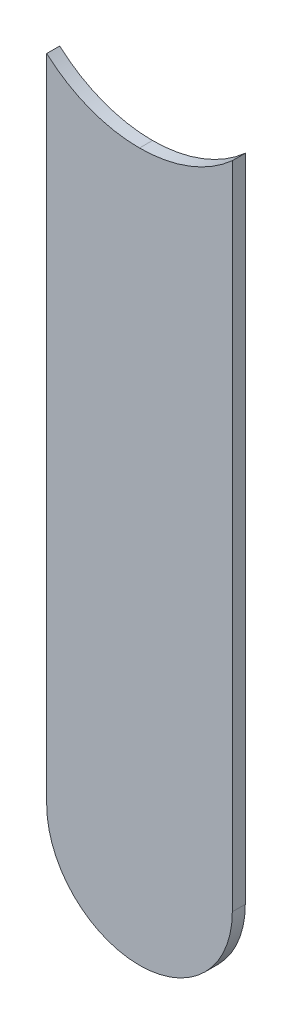
ISO-10303-21;
HEADER;
FILE_DESCRIPTION(('STEP AP214'),'2;1');
FILE_NAME('part.step','',(''),(''),'','','');
FILE_SCHEMA(('AUTOMOTIVE_DESIGN { 1 0 10303 214 1 1 1 1 }'));
ENDSEC;
DATA;
#1=APPLICATION_CONTEXT('core data for automotive mechanical design processes');
#2=APPLICATION_PROTOCOL_DEFINITION('international standard','automotive_design',2000,#1);
#3=PRODUCT_CONTEXT('',#1,'mechanical');
#4=PRODUCT('Part','Part','',(#3));
#5=PRODUCT_RELATED_PRODUCT_CATEGORY('part','',(#4));
#6=PRODUCT_DEFINITION_FORMATION('','',#4);
#7=PRODUCT_DEFINITION_CONTEXT('part definition',#1,'design');
#8=PRODUCT_DEFINITION('design','',#6,#7);
#9=PRODUCT_DEFINITION_SHAPE('','',#8);
#10=(LENGTH_UNIT() NAMED_UNIT(*) SI_UNIT(.MILLI.,.METRE.));
#11=(NAMED_UNIT(*) PLANE_ANGLE_UNIT() SI_UNIT($,.RADIAN.));
#12=(NAMED_UNIT(*) SI_UNIT($,.STERADIAN.) SOLID_ANGLE_UNIT());
#13=UNCERTAINTY_MEASURE_WITH_UNIT(LENGTH_MEASURE(1.E-05),#10,'distance_accuracy_value','');
#14=(GEOMETRIC_REPRESENTATION_CONTEXT(3) GLOBAL_UNCERTAINTY_ASSIGNED_CONTEXT((#13)) GLOBAL_UNIT_ASSIGNED_CONTEXT((#10,
#11,#12)) REPRESENTATION_CONTEXT('',''));
#15=CARTESIAN_POINT('',(0.,0.,0.));
#16=DIRECTION('',(0.,0.,1.));
#17=DIRECTION('',(1.,0.,0.));
#18=AXIS2_PLACEMENT_3D('',#15,#16,#17);
#19=CARTESIAN_POINT('',(144.78,-103.632,-0.045));
#20=DIRECTION('',(0.,0.,-1.));
#21=DIRECTION('',(0.,-1.,0.));
#22=AXIS2_PLACEMENT_3D('',#19,#20,#21);
#23=CYLINDRICAL_SURFACE('',#22,0.375);
#24=DIRECTION('',(0.,0.,1.));
#25=VECTOR('',#24,1.);
#26=CARTESIAN_POINT('',(144.78,-104.007,-0.045));
#27=LINE('',#26,#25);
#28=CARTESIAN_POINT('',(144.78,-104.007,-0.035));
#29=VERTEX_POINT('',#28);
#30=CARTESIAN_POINT('',(144.78,-104.007,0.));
#31=VERTEX_POINT('',#30);
#32=EDGE_CURVE('E85',#29,#31,#27,.T.);
#33=ORIENTED_EDGE('',*,*,#32,.F.);
#34=CARTESIAN_POINT('',(144.78,-103.632,-0.035));
#35=DIRECTION('',(0.,0.,-1.));
#36=DIRECTION('',(0.,-1.,0.));
#37=AXIS2_PLACEMENT_3D('',#34,#35,#36);
#38=CIRCLE('',#37,0.375);
#39=CARTESIAN_POINT('',(144.53,-103.9115084971,-0.035));
#40=VERTEX_POINT('',#39);
#41=EDGE_CURVE('E113',#29,#40,#38,.T.);
#42=ORIENTED_EDGE('',*,*,#41,.T.);
#43=DIRECTION('',(0.,0.,-1.));
#44=VECTOR('',#43,1.);
#45=CARTESIAN_POINT('',(144.53,-103.9115084971,-0.045));
#46=LINE('',#45,#44);
#47=CARTESIAN_POINT('',(144.53,-103.9115084971,0.));
#48=VERTEX_POINT('',#47);
#49=EDGE_CURVE('E11',#48,#40,#46,.T.);
#50=ORIENTED_EDGE('',*,*,#49,.F.);
#51=CARTESIAN_POINT('',(144.78,-103.632,0.));
#52=DIRECTION('',(0.,0.,-1.));
#53=DIRECTION('',(0.,-1.,0.));
#54=AXIS2_PLACEMENT_3D('',#51,#52,#53);
#55=CIRCLE('',#54,0.375);
#56=EDGE_CURVE('E117',#31,#48,#55,.T.);
#57=ORIENTED_EDGE('',*,*,#56,.F.);
#58=EDGE_LOOP('',(#33,#42,#50,#57));
#59=FACE_BOUND('',#58,.T.);
#60=ADVANCED_FACE('F17',(#59),#23,.F.);
#61=CARTESIAN_POINT('',(144.53,-103.632,-0.035));
#62=DIRECTION('',(1.,0.,0.));
#63=DIRECTION('',(0.,1.,0.));
#64=AXIS2_PLACEMENT_3D('',#61,#62,#63);
#65=PLANE('',#64);
#66=DIRECTION('',(0.,0.,1.));
#67=VECTOR('',#66,1.);
#68=CARTESIAN_POINT('',(144.53,-105.664,-0.035));
#69=LINE('',#68,#67);
#70=CARTESIAN_POINT('',(144.53,-105.664,-0.035));
#71=VERTEX_POINT('',#70);
#72=CARTESIAN_POINT('',(144.53,-105.664,0.));
#73=VERTEX_POINT('',#72);
#74=EDGE_CURVE('E20',#71,#73,#69,.T.);
#75=ORIENTED_EDGE('',*,*,#74,.T.);
#76=DIRECTION('',(0.,-1.,0.));
#77=VECTOR('',#76,1.);
#78=CARTESIAN_POINT('',(144.53,-103.632,0.));
#79=LINE('',#78,#77);
#80=EDGE_CURVE('E120',#48,#73,#79,.T.);
#81=ORIENTED_EDGE('',*,*,#80,.F.);
#82=ORIENTED_EDGE('',*,*,#49,.T.);
#83=DIRECTION('',(0.,-1.,0.));
#84=VECTOR('',#83,1.);
#85=CARTESIAN_POINT('',(144.53,-103.632,-0.035));
#86=LINE('',#85,#84);
#87=EDGE_CURVE('E111',#40,#71,#86,.T.);
#88=ORIENTED_EDGE('',*,*,#87,.T.);
#89=EDGE_LOOP('',(#75,#81,#82,#88));
#90=FACE_BOUND('',#89,.T.);
#91=ADVANCED_FACE('F190',(#90),#65,.F.);
#92=CARTESIAN_POINT('',(144.78,-105.664,-0.035));
#93=DIRECTION('',(0.,0.,-1.));
#94=DIRECTION('',(-1.,0.,0.));
#95=AXIS2_PLACEMENT_3D('',#92,#93,#94);
#96=CYLINDRICAL_SURFACE('',#95,0.25);
#97=CARTESIAN_POINT('',(144.78,-105.664,-0.035));
#98=DIRECTION('',(0.,0.,1.));
#99=DIRECTION('',(-1.,0.,0.));
#100=AXIS2_PLACEMENT_3D('',#97,#98,#99);
#101=CIRCLE('',#100,0.25);
#102=CARTESIAN_POINT('',(145.03,-105.664,-0.035));
#103=VERTEX_POINT('',#102);
#104=EDGE_CURVE('E128',#71,#103,#101,.T.);
#105=ORIENTED_EDGE('',*,*,#104,.T.);
#106=DIRECTION('',(0.,0.,1.));
#107=VECTOR('',#106,1.);
#108=CARTESIAN_POINT('',(145.03,-105.664,-0.035));
#109=LINE('',#108,#107);
#110=CARTESIAN_POINT('',(145.03,-105.664,0.));
#111=VERTEX_POINT('',#110);
#112=EDGE_CURVE('E99',#103,#111,#109,.T.);
#113=ORIENTED_EDGE('',*,*,#112,.T.);
#114=CARTESIAN_POINT('',(144.78,-105.664,0.));
#115=DIRECTION('',(0.,0.,1.));
#116=DIRECTION('',(-1.,0.,0.));
#117=AXIS2_PLACEMENT_3D('',#114,#115,#116);
#118=CIRCLE('',#117,0.25);
#119=EDGE_CURVE('E89',#73,#111,#118,.T.);
#120=ORIENTED_EDGE('',*,*,#119,.F.);
#121=ORIENTED_EDGE('',*,*,#74,.F.);
#122=EDGE_LOOP('',(#105,#113,#120,#121));
#123=FACE_BOUND('',#122,.T.);
#124=ADVANCED_FACE('F180',(#123),#96,.T.);
#125=CARTESIAN_POINT('',(145.03,-105.664,0.));
#126=DIRECTION('',(0.,0.,1.));
#127=DIRECTION('',(1.,0.,0.));
#128=AXIS2_PLACEMENT_3D('',#125,#126,#127);
#129=PLANE('',#128);
#130=ORIENTED_EDGE('',*,*,#119,.T.);
#131=DIRECTION('',(0.,1.,0.));
#132=VECTOR('',#131,1.);
#133=CARTESIAN_POINT('',(145.03,-105.664,0.));
#134=LINE('',#133,#132);
#135=CARTESIAN_POINT('',(145.03,-103.9115084971,0.));
#136=VERTEX_POINT('',#135);
#137=EDGE_CURVE('E92',#111,#136,#134,.T.);
#138=ORIENTED_EDGE('',*,*,#137,.T.);
#139=CARTESIAN_POINT('',(144.78,-103.632,0.));
#140=DIRECTION('',(0.,0.,-1.));
#141=DIRECTION('',(0.,-1.,0.));
#142=AXIS2_PLACEMENT_3D('',#139,#140,#141);
#143=CIRCLE('',#142,0.375);
#144=EDGE_CURVE('E79',#136,#31,#143,.T.);
#145=ORIENTED_EDGE('',*,*,#144,.T.);
#146=ORIENTED_EDGE('',*,*,#56,.T.);
#147=ORIENTED_EDGE('',*,*,#80,.T.);
#148=EDGE_LOOP('',(#130,#138,#145,#146,#147));
#149=FACE_BOUND('',#148,.T.);
#150=ADVANCED_FACE('F93',(#149),#129,.T.);
#151=CARTESIAN_POINT('',(144.78,-103.632,-0.045));
#152=DIRECTION('',(0.,0.,-1.));
#153=DIRECTION('',(0.,-1.,0.));
#154=AXIS2_PLACEMENT_3D('',#151,#152,#153);
#155=CYLINDRICAL_SURFACE('',#154,0.375);
#156=CARTESIAN_POINT('',(144.78,-103.632,-0.035));
#157=DIRECTION('',(0.,0.,-1.));
#158=DIRECTION('',(0.,-1.,0.));
#159=AXIS2_PLACEMENT_3D('',#156,#157,#158);
#160=CIRCLE('',#159,0.375);
#161=CARTESIAN_POINT('',(145.03,-103.9115084971,-0.035));
#162=VERTEX_POINT('',#161);
#163=EDGE_CURVE('E123',#162,#29,#160,.T.);
#164=ORIENTED_EDGE('',*,*,#163,.T.);
#165=ORIENTED_EDGE('',*,*,#32,.T.);
#166=ORIENTED_EDGE('',*,*,#144,.F.);
#167=DIRECTION('',(0.,0.,-1.));
#168=VECTOR('',#167,1.);
#169=CARTESIAN_POINT('',(145.03,-103.9115084971,-0.045));
#170=LINE('',#169,#168);
#171=EDGE_CURVE('E84',#136,#162,#170,.T.);
#172=ORIENTED_EDGE('',*,*,#171,.T.);
#173=EDGE_LOOP('',(#164,#165,#166,#172));
#174=FACE_BOUND('',#173,.T.);
#175=ADVANCED_FACE('F82',(#174),#155,.F.);
#176=CARTESIAN_POINT('',(145.03,-105.664,-0.035));
#177=DIRECTION('',(0.,0.,1.));
#178=DIRECTION('',(1.,0.,0.));
#179=AXIS2_PLACEMENT_3D('',#176,#177,#178);
#180=PLANE('',#179);
#181=ORIENTED_EDGE('',*,*,#87,.F.);
#182=ORIENTED_EDGE('',*,*,#41,.F.);
#183=ORIENTED_EDGE('',*,*,#163,.F.);
#184=DIRECTION('',(0.,1.,0.));
#185=VECTOR('',#184,1.);
#186=CARTESIAN_POINT('',(145.03,-105.664,-0.035));
#187=LINE('',#186,#185);
#188=EDGE_CURVE('E104',#103,#162,#187,.T.);
#189=ORIENTED_EDGE('',*,*,#188,.F.);
#190=ORIENTED_EDGE('',*,*,#104,.F.);
#191=EDGE_LOOP('',(#181,#182,#183,#189,#190));
#192=FACE_BOUND('',#191,.T.);
#193=ADVANCED_FACE('F154',(#192),#180,.F.);
#194=CARTESIAN_POINT('',(145.03,-105.664,-0.035));
#195=DIRECTION('',(-1.,0.,0.));
#196=DIRECTION('',(0.,0.,1.));
#197=AXIS2_PLACEMENT_3D('',#194,#195,#196);
#198=PLANE('',#197);
#199=ORIENTED_EDGE('',*,*,#171,.F.);
#200=ORIENTED_EDGE('',*,*,#137,.F.);
#201=ORIENTED_EDGE('',*,*,#112,.F.);
#202=ORIENTED_EDGE('',*,*,#188,.T.);
#203=EDGE_LOOP('',(#199,#200,#201,#202));
#204=FACE_BOUND('',#203,.T.);
#205=ADVANCED_FACE('F102',(#204),#198,.F.);
#206=CLOSED_SHELL('',(#60,#91,#124,#150,#175,#193,#205));
#207=MANIFOLD_SOLID_BREP('B1',#206);
#208=ADVANCED_BREP_SHAPE_REPRESENTATION('',(#18,#207),#14);
#209=SHAPE_DEFINITION_REPRESENTATION(#9,#208);
ENDSEC;
END-ISO-10303-21;
